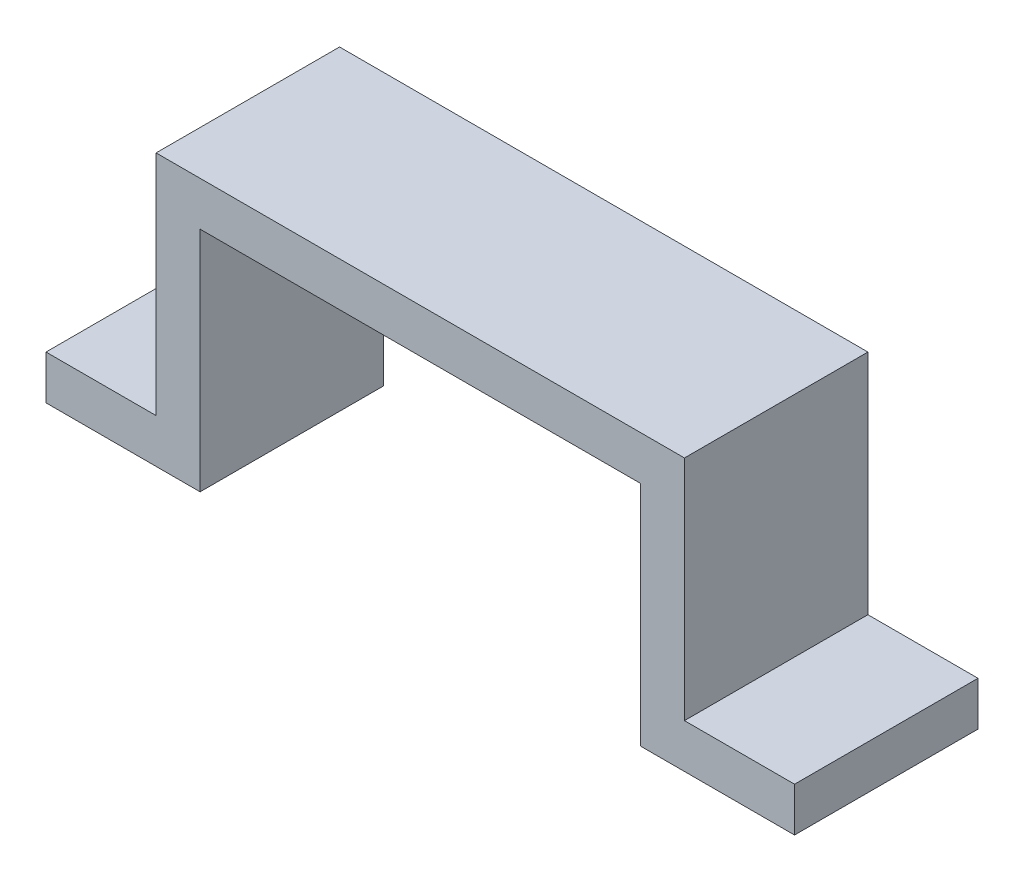
ISO-10303-21;
HEADER;
FILE_DESCRIPTION(('STEP AP214'),'2;1');
FILE_NAME('part.step','',(''),(''),'','','');
FILE_SCHEMA(('AUTOMOTIVE_DESIGN { 1 0 10303 214 1 1 1 1 }'));
ENDSEC;
DATA;
#1=APPLICATION_CONTEXT('core data for automotive mechanical design processes');
#2=APPLICATION_PROTOCOL_DEFINITION('international standard','automotive_design',2000,#1);
#3=PRODUCT_CONTEXT('',#1,'mechanical');
#4=PRODUCT('Part','Part','',(#3));
#5=PRODUCT_RELATED_PRODUCT_CATEGORY('part','',(#4));
#6=PRODUCT_DEFINITION_FORMATION('','',#4);
#7=PRODUCT_DEFINITION_CONTEXT('part definition',#1,'design');
#8=PRODUCT_DEFINITION('design','',#6,#7);
#9=PRODUCT_DEFINITION_SHAPE('','',#8);
#10=(LENGTH_UNIT() NAMED_UNIT(*) SI_UNIT(.MILLI.,.METRE.));
#11=(NAMED_UNIT(*) PLANE_ANGLE_UNIT() SI_UNIT($,.RADIAN.));
#12=(NAMED_UNIT(*) SI_UNIT($,.STERADIAN.) SOLID_ANGLE_UNIT());
#13=UNCERTAINTY_MEASURE_WITH_UNIT(LENGTH_MEASURE(1.E-05),#10,'distance_accuracy_value','');
#14=(GEOMETRIC_REPRESENTATION_CONTEXT(3) GLOBAL_UNCERTAINTY_ASSIGNED_CONTEXT((#13)) GLOBAL_UNIT_ASSIGNED_CONTEXT((#10,
#11,#12)) REPRESENTATION_CONTEXT('',''));
#15=CARTESIAN_POINT('',(0.,0.,0.));
#16=DIRECTION('',(0.,0.,1.));
#17=DIRECTION('',(1.,0.,0.));
#18=AXIS2_PLACEMENT_3D('',#15,#16,#17);
#19=CARTESIAN_POINT('',(0.,-6.,25.));
#20=DIRECTION('',(1.,0.,0.));
#21=DIRECTION('',(0.,0.,-1.));
#22=AXIS2_PLACEMENT_3D('',#19,#20,#21);
#23=PLANE('',#22);
#24=DIRECTION('',(0.,-1.,0.));
#25=VECTOR('',#24,1.);
#26=CARTESIAN_POINT('',(0.,-6.,0.));
#27=LINE('',#26,#25);
#28=CARTESIAN_POINT('',(0.,0.,0.));
#29=VERTEX_POINT('',#28);
#30=CARTESIAN_POINT('',(0.,-6.,0.));
#31=VERTEX_POINT('',#30);
#32=EDGE_CURVE('E156',#29,#31,#27,.T.);
#33=ORIENTED_EDGE('',*,*,#32,.T.);
#34=DIRECTION('',(0.,0.,-1.));
#35=VECTOR('',#34,1.);
#36=CARTESIAN_POINT('',(0.,-6.,25.));
#37=LINE('',#36,#35);
#38=CARTESIAN_POINT('',(0.,-6.,25.));
#39=VERTEX_POINT('',#38);
#40=EDGE_CURVE('E11',#39,#31,#37,.T.);
#41=ORIENTED_EDGE('',*,*,#40,.F.);
#42=DIRECTION('',(0.,-1.,0.));
#43=VECTOR('',#42,1.);
#44=CARTESIAN_POINT('',(0.,-6.,25.));
#45=LINE('',#44,#43);
#46=CARTESIAN_POINT('',(0.,0.,25.));
#47=VERTEX_POINT('',#46);
#48=EDGE_CURVE('E178',#47,#39,#45,.T.);
#49=ORIENTED_EDGE('',*,*,#48,.F.);
#50=DIRECTION('',(0.,0.,-1.));
#51=VECTOR('',#50,1.);
#52=CARTESIAN_POINT('',(0.,0.,25.));
#53=LINE('',#52,#51);
#54=EDGE_CURVE('E152',#47,#29,#53,.T.);
#55=ORIENTED_EDGE('',*,*,#54,.T.);
#56=EDGE_LOOP('',(#33,#41,#49,#55));
#57=FACE_BOUND('',#56,.T.);
#58=ADVANCED_FACE('F36',(#57),#23,.F.);
#59=CARTESIAN_POINT('',(21.,-6.,25.));
#60=DIRECTION('',(0.,1.,0.));
#61=DIRECTION('',(-1.,0.,0.));
#62=AXIS2_PLACEMENT_3D('',#59,#60,#61);
#63=PLANE('',#62);
#64=DIRECTION('',(1.,0.,0.));
#65=VECTOR('',#64,1.);
#66=CARTESIAN_POINT('',(21.,-6.,0.));
#67=LINE('',#66,#65);
#68=CARTESIAN_POINT('',(21.,-6.,0.));
#69=VERTEX_POINT('',#68);
#70=EDGE_CURVE('E159',#31,#69,#67,.T.);
#71=ORIENTED_EDGE('',*,*,#70,.T.);
#72=DIRECTION('',(0.,0.,-1.));
#73=VECTOR('',#72,1.);
#74=CARTESIAN_POINT('',(21.,-6.,25.));
#75=LINE('',#74,#73);
#76=CARTESIAN_POINT('',(21.,-6.,25.));
#77=VERTEX_POINT('',#76);
#78=EDGE_CURVE('E44',#77,#69,#75,.T.);
#79=ORIENTED_EDGE('',*,*,#78,.F.);
#80=DIRECTION('',(1.,0.,0.));
#81=VECTOR('',#80,1.);
#82=CARTESIAN_POINT('',(21.,-6.,25.));
#83=LINE('',#82,#81);
#84=EDGE_CURVE('E107',#39,#77,#83,.T.);
#85=ORIENTED_EDGE('',*,*,#84,.F.);
#86=ORIENTED_EDGE('',*,*,#40,.T.);
#87=EDGE_LOOP('',(#71,#79,#85,#86));
#88=FACE_BOUND('',#87,.T.);
#89=ADVANCED_FACE('F256',(#88),#63,.F.);
#90=CARTESIAN_POINT('',(21.,25.,25.));
#91=DIRECTION('',(-1.,0.,0.));
#92=DIRECTION('',(0.,-1.,0.));
#93=AXIS2_PLACEMENT_3D('',#90,#91,#92);
#94=PLANE('',#93);
#95=DIRECTION('',(0.,1.,0.));
#96=VECTOR('',#95,1.);
#97=CARTESIAN_POINT('',(21.,25.,0.));
#98=LINE('',#97,#96);
#99=CARTESIAN_POINT('',(21.,25.,0.));
#100=VERTEX_POINT('',#99);
#101=EDGE_CURVE('E161',#69,#100,#98,.T.);
#102=ORIENTED_EDGE('',*,*,#101,.T.);
#103=DIRECTION('',(0.,0.,-1.));
#104=VECTOR('',#103,1.);
#105=CARTESIAN_POINT('',(21.,25.,25.));
#106=LINE('',#105,#104);
#107=CARTESIAN_POINT('',(21.,25.,25.));
#108=VERTEX_POINT('',#107);
#109=EDGE_CURVE('E197',#108,#100,#106,.T.);
#110=ORIENTED_EDGE('',*,*,#109,.F.);
#111=DIRECTION('',(0.,1.,0.));
#112=VECTOR('',#111,1.);
#113=CARTESIAN_POINT('',(21.,25.,25.));
#114=LINE('',#113,#112);
#115=EDGE_CURVE('E205',#77,#108,#114,.T.);
#116=ORIENTED_EDGE('',*,*,#115,.F.);
#117=ORIENTED_EDGE('',*,*,#78,.T.);
#118=EDGE_LOOP('',(#102,#110,#116,#117));
#119=FACE_BOUND('',#118,.T.);
#120=ADVANCED_FACE('F203',(#119),#94,.F.);
#121=CARTESIAN_POINT('',(81.,25.,25.));
#122=DIRECTION('',(0.,1.,0.));
#123=DIRECTION('',(-1.,0.,0.));
#124=AXIS2_PLACEMENT_3D('',#121,#122,#123);
#125=PLANE('',#124);
#126=DIRECTION('',(1.,0.,0.));
#127=VECTOR('',#126,1.);
#128=CARTESIAN_POINT('',(81.,25.,0.));
#129=LINE('',#128,#127);
#130=CARTESIAN_POINT('',(81.,25.,0.));
#131=VERTEX_POINT('',#130);
#132=EDGE_CURVE('E163',#100,#131,#129,.T.);
#133=ORIENTED_EDGE('',*,*,#132,.T.);
#134=DIRECTION('',(0.,0.,-1.));
#135=VECTOR('',#134,1.);
#136=CARTESIAN_POINT('',(81.,25.,25.));
#137=LINE('',#136,#135);
#138=CARTESIAN_POINT('',(81.,25.,25.));
#139=VERTEX_POINT('',#138);
#140=EDGE_CURVE('E194',#139,#131,#137,.T.);
#141=ORIENTED_EDGE('',*,*,#140,.F.);
#142=DIRECTION('',(1.,0.,0.));
#143=VECTOR('',#142,1.);
#144=CARTESIAN_POINT('',(81.,25.,25.));
#145=LINE('',#144,#143);
#146=EDGE_CURVE('E223',#108,#139,#145,.T.);
#147=ORIENTED_EDGE('',*,*,#146,.F.);
#148=ORIENTED_EDGE('',*,*,#109,.T.);
#149=EDGE_LOOP('',(#133,#141,#147,#148));
#150=FACE_BOUND('',#149,.T.);
#151=ADVANCED_FACE('F214',(#150),#125,.F.);
#152=CARTESIAN_POINT('',(81.,-6.,25.));
#153=DIRECTION('',(1.,0.,0.));
#154=DIRECTION('',(0.,1.,0.));
#155=AXIS2_PLACEMENT_3D('',#152,#153,#154);
#156=PLANE('',#155);
#157=DIRECTION('',(0.,-1.,0.));
#158=VECTOR('',#157,1.);
#159=CARTESIAN_POINT('',(81.,-6.,0.));
#160=LINE('',#159,#158);
#161=CARTESIAN_POINT('',(81.,-6.,0.));
#162=VERTEX_POINT('',#161);
#163=EDGE_CURVE('E165',#131,#162,#160,.T.);
#164=ORIENTED_EDGE('',*,*,#163,.T.);
#165=DIRECTION('',(0.,0.,-1.));
#166=VECTOR('',#165,1.);
#167=CARTESIAN_POINT('',(81.,-6.,25.));
#168=LINE('',#167,#166);
#169=CARTESIAN_POINT('',(81.,-6.,25.));
#170=VERTEX_POINT('',#169);
#171=EDGE_CURVE('E191',#170,#162,#168,.T.);
#172=ORIENTED_EDGE('',*,*,#171,.F.);
#173=DIRECTION('',(0.,-1.,0.));
#174=VECTOR('',#173,1.);
#175=CARTESIAN_POINT('',(81.,-6.,25.));
#176=LINE('',#175,#174);
#177=EDGE_CURVE('E220',#139,#170,#176,.T.);
#178=ORIENTED_EDGE('',*,*,#177,.F.);
#179=ORIENTED_EDGE('',*,*,#140,.T.);
#180=EDGE_LOOP('',(#164,#172,#178,#179));
#181=FACE_BOUND('',#180,.T.);
#182=ADVANCED_FACE('F218',(#181),#156,.F.);
#183=CARTESIAN_POINT('',(102.,-6.,25.));
#184=DIRECTION('',(0.,1.,0.));
#185=DIRECTION('',(-1.,0.,0.));
#186=AXIS2_PLACEMENT_3D('',#183,#184,#185);
#187=PLANE('',#186);
#188=DIRECTION('',(1.,0.,0.));
#189=VECTOR('',#188,1.);
#190=CARTESIAN_POINT('',(102.,-6.,0.));
#191=LINE('',#190,#189);
#192=CARTESIAN_POINT('',(102.,-6.,0.));
#193=VERTEX_POINT('',#192);
#194=EDGE_CURVE('E167',#162,#193,#191,.T.);
#195=ORIENTED_EDGE('',*,*,#194,.T.);
#196=DIRECTION('',(0.,0.,-1.));
#197=VECTOR('',#196,1.);
#198=CARTESIAN_POINT('',(102.,-6.,25.));
#199=LINE('',#198,#197);
#200=CARTESIAN_POINT('',(102.,-6.,25.));
#201=VERTEX_POINT('',#200);
#202=EDGE_CURVE('E188',#201,#193,#199,.T.);
#203=ORIENTED_EDGE('',*,*,#202,.F.);
#204=DIRECTION('',(1.,0.,0.));
#205=VECTOR('',#204,1.);
#206=CARTESIAN_POINT('',(102.,-6.,25.));
#207=LINE('',#206,#205);
#208=EDGE_CURVE('E222',#170,#201,#207,.T.);
#209=ORIENTED_EDGE('',*,*,#208,.F.);
#210=ORIENTED_EDGE('',*,*,#171,.T.);
#211=EDGE_LOOP('',(#195,#203,#209,#210));
#212=FACE_BOUND('',#211,.T.);
#213=ADVANCED_FACE('F269',(#212),#187,.F.);
#214=CARTESIAN_POINT('',(102.,0.,25.));
#215=DIRECTION('',(-1.,0.,0.));
#216=DIRECTION('',(0.,0.,1.));
#217=AXIS2_PLACEMENT_3D('',#214,#215,#216);
#218=PLANE('',#217);
#219=DIRECTION('',(0.,1.,0.));
#220=VECTOR('',#219,1.);
#221=CARTESIAN_POINT('',(102.,0.,0.));
#222=LINE('',#221,#220);
#223=CARTESIAN_POINT('',(102.,0.,0.));
#224=VERTEX_POINT('',#223);
#225=EDGE_CURVE('E169',#193,#224,#222,.T.);
#226=ORIENTED_EDGE('',*,*,#225,.T.);
#227=DIRECTION('',(0.,0.,-1.));
#228=VECTOR('',#227,1.);
#229=CARTESIAN_POINT('',(102.,0.,25.));
#230=LINE('',#229,#228);
#231=CARTESIAN_POINT('',(102.,0.,25.));
#232=VERTEX_POINT('',#231);
#233=EDGE_CURVE('E185',#232,#224,#230,.T.);
#234=ORIENTED_EDGE('',*,*,#233,.F.);
#235=DIRECTION('',(0.,1.,0.));
#236=VECTOR('',#235,1.);
#237=CARTESIAN_POINT('',(102.,0.,25.));
#238=LINE('',#237,#236);
#239=EDGE_CURVE('E225',#201,#232,#238,.T.);
#240=ORIENTED_EDGE('',*,*,#239,.F.);
#241=ORIENTED_EDGE('',*,*,#202,.T.);
#242=EDGE_LOOP('',(#226,#234,#240,#241));
#243=FACE_BOUND('',#242,.T.);
#244=ADVANCED_FACE('F272',(#243),#218,.F.);
#245=CARTESIAN_POINT('',(87.,0.,25.));
#246=DIRECTION('',(0.,-1.,0.));
#247=DIRECTION('',(1.,0.,0.));
#248=AXIS2_PLACEMENT_3D('',#245,#246,#247);
#249=PLANE('',#248);
#250=DIRECTION('',(-1.,0.,0.));
#251=VECTOR('',#250,1.);
#252=CARTESIAN_POINT('',(87.,0.,0.));
#253=LINE('',#252,#251);
#254=CARTESIAN_POINT('',(87.,0.,0.));
#255=VERTEX_POINT('',#254);
#256=EDGE_CURVE('E171',#224,#255,#253,.T.);
#257=ORIENTED_EDGE('',*,*,#256,.T.);
#258=DIRECTION('',(0.,0.,-1.));
#259=VECTOR('',#258,1.);
#260=CARTESIAN_POINT('',(87.,0.,25.));
#261=LINE('',#260,#259);
#262=CARTESIAN_POINT('',(87.,0.,25.));
#263=VERTEX_POINT('',#262);
#264=EDGE_CURVE('E182',#263,#255,#261,.T.);
#265=ORIENTED_EDGE('',*,*,#264,.F.);
#266=DIRECTION('',(-1.,0.,0.));
#267=VECTOR('',#266,1.);
#268=CARTESIAN_POINT('',(87.,0.,25.));
#269=LINE('',#268,#267);
#270=EDGE_CURVE('E231',#232,#263,#269,.T.);
#271=ORIENTED_EDGE('',*,*,#270,.F.);
#272=ORIENTED_EDGE('',*,*,#233,.T.);
#273=EDGE_LOOP('',(#257,#265,#271,#272));
#274=FACE_BOUND('',#273,.T.);
#275=ADVANCED_FACE('F237',(#274),#249,.F.);
#276=CARTESIAN_POINT('',(87.,31.,25.));
#277=DIRECTION('',(-1.,0.,0.));
#278=DIRECTION('',(0.,0.,1.));
#279=AXIS2_PLACEMENT_3D('',#276,#277,#278);
#280=PLANE('',#279);
#281=DIRECTION('',(0.,1.,0.));
#282=VECTOR('',#281,1.);
#283=CARTESIAN_POINT('',(87.,31.,0.));
#284=LINE('',#283,#282);
#285=CARTESIAN_POINT('',(87.,31.,0.));
#286=VERTEX_POINT('',#285);
#287=EDGE_CURVE('E173',#255,#286,#284,.T.);
#288=ORIENTED_EDGE('',*,*,#287,.T.);
#289=DIRECTION('',(0.,0.,-1.));
#290=VECTOR('',#289,1.);
#291=CARTESIAN_POINT('',(87.,31.,25.));
#292=LINE('',#291,#290);
#293=CARTESIAN_POINT('',(87.,31.,25.));
#294=VERTEX_POINT('',#293);
#295=EDGE_CURVE('E147',#294,#286,#292,.T.);
#296=ORIENTED_EDGE('',*,*,#295,.F.);
#297=DIRECTION('',(0.,1.,0.));
#298=VECTOR('',#297,1.);
#299=CARTESIAN_POINT('',(87.,31.,25.));
#300=LINE('',#299,#298);
#301=EDGE_CURVE('E138',#263,#294,#300,.T.);
#302=ORIENTED_EDGE('',*,*,#301,.F.);
#303=ORIENTED_EDGE('',*,*,#264,.T.);
#304=EDGE_LOOP('',(#288,#296,#302,#303));
#305=FACE_BOUND('',#304,.T.);
#306=ADVANCED_FACE('F241',(#305),#280,.F.);
#307=CARTESIAN_POINT('',(15.,31.,25.));
#308=DIRECTION('',(0.,-1.,0.));
#309=DIRECTION('',(0.,0.,-1.));
#310=AXIS2_PLACEMENT_3D('',#307,#308,#309);
#311=PLANE('',#310);
#312=DIRECTION('',(-1.,0.,0.));
#313=VECTOR('',#312,1.);
#314=CARTESIAN_POINT('',(15.,31.,0.));
#315=LINE('',#314,#313);
#316=CARTESIAN_POINT('',(15.,31.,0.));
#317=VERTEX_POINT('',#316);
#318=EDGE_CURVE('E146',#286,#317,#315,.T.);
#319=ORIENTED_EDGE('',*,*,#318,.T.);
#320=DIRECTION('',(0.,0.,-1.));
#321=VECTOR('',#320,1.);
#322=CARTESIAN_POINT('',(15.,31.,25.));
#323=LINE('',#322,#321);
#324=CARTESIAN_POINT('',(15.,31.,25.));
#325=VERTEX_POINT('',#324);
#326=EDGE_CURVE('E143',#325,#317,#323,.T.);
#327=ORIENTED_EDGE('',*,*,#326,.F.);
#328=DIRECTION('',(-1.,0.,0.));
#329=VECTOR('',#328,1.);
#330=CARTESIAN_POINT('',(15.,31.,25.));
#331=LINE('',#330,#329);
#332=EDGE_CURVE('E132',#294,#325,#331,.T.);
#333=ORIENTED_EDGE('',*,*,#332,.F.);
#334=ORIENTED_EDGE('',*,*,#295,.T.);
#335=EDGE_LOOP('',(#319,#327,#333,#334));
#336=FACE_BOUND('',#335,.T.);
#337=ADVANCED_FACE('F144',(#336),#311,.F.);
#338=CARTESIAN_POINT('',(15.,0.,25.));
#339=DIRECTION('',(1.,0.,0.));
#340=DIRECTION('',(0.,0.,-1.));
#341=AXIS2_PLACEMENT_3D('',#338,#339,#340);
#342=PLANE('',#341);
#343=DIRECTION('',(0.,-1.,0.));
#344=VECTOR('',#343,1.);
#345=CARTESIAN_POINT('',(15.,0.,0.));
#346=LINE('',#345,#344);
#347=CARTESIAN_POINT('',(15.,0.,0.));
#348=VERTEX_POINT('',#347);
#349=EDGE_CURVE('E93',#317,#348,#346,.T.);
#350=ORIENTED_EDGE('',*,*,#349,.T.);
#351=DIRECTION('',(0.,0.,-1.));
#352=VECTOR('',#351,1.);
#353=CARTESIAN_POINT('',(15.,0.,25.));
#354=LINE('',#353,#352);
#355=CARTESIAN_POINT('',(15.,0.,25.));
#356=VERTEX_POINT('',#355);
#357=EDGE_CURVE('E148',#356,#348,#354,.T.);
#358=ORIENTED_EDGE('',*,*,#357,.F.);
#359=DIRECTION('',(0.,-1.,0.));
#360=VECTOR('',#359,1.);
#361=CARTESIAN_POINT('',(15.,0.,25.));
#362=LINE('',#361,#360);
#363=EDGE_CURVE('E136',#325,#356,#362,.T.);
#364=ORIENTED_EDGE('',*,*,#363,.F.);
#365=ORIENTED_EDGE('',*,*,#326,.T.);
#366=EDGE_LOOP('',(#350,#358,#364,#365));
#367=FACE_BOUND('',#366,.T.);
#368=ADVANCED_FACE('F150',(#367),#342,.F.);
#369=CARTESIAN_POINT('',(0.,0.,25.));
#370=DIRECTION('',(0.,-1.,0.));
#371=DIRECTION('',(0.,0.,-1.));
#372=AXIS2_PLACEMENT_3D('',#369,#370,#371);
#373=PLANE('',#372);
#374=DIRECTION('',(-1.,0.,0.));
#375=VECTOR('',#374,1.);
#376=CARTESIAN_POINT('',(0.,0.,0.));
#377=LINE('',#376,#375);
#378=EDGE_CURVE('E99',#348,#29,#377,.T.);
#379=ORIENTED_EDGE('',*,*,#378,.T.);
#380=ORIENTED_EDGE('',*,*,#54,.F.);
#381=DIRECTION('',(-1.,0.,0.));
#382=VECTOR('',#381,1.);
#383=CARTESIAN_POINT('',(0.,0.,25.));
#384=LINE('',#383,#382);
#385=EDGE_CURVE('E52',#356,#47,#384,.T.);
#386=ORIENTED_EDGE('',*,*,#385,.F.);
#387=ORIENTED_EDGE('',*,*,#357,.T.);
#388=EDGE_LOOP('',(#379,#380,#386,#387));
#389=FACE_BOUND('',#388,.T.);
#390=ADVANCED_FACE('F245',(#389),#373,.F.);
#391=CARTESIAN_POINT('',(0.,0.,25.));
#392=DIRECTION('',(0.,0.,-1.));
#393=DIRECTION('',(-1.,0.,0.));
#394=AXIS2_PLACEMENT_3D('',#391,#392,#393);
#395=PLANE('',#394);
#396=ORIENTED_EDGE('',*,*,#48,.T.);
#397=ORIENTED_EDGE('',*,*,#84,.T.);
#398=ORIENTED_EDGE('',*,*,#115,.T.);
#399=ORIENTED_EDGE('',*,*,#146,.T.);
#400=ORIENTED_EDGE('',*,*,#177,.T.);
#401=ORIENTED_EDGE('',*,*,#208,.T.);
#402=ORIENTED_EDGE('',*,*,#239,.T.);
#403=ORIENTED_EDGE('',*,*,#270,.T.);
#404=ORIENTED_EDGE('',*,*,#301,.T.);
#405=ORIENTED_EDGE('',*,*,#332,.T.);
#406=ORIENTED_EDGE('',*,*,#363,.T.);
#407=ORIENTED_EDGE('',*,*,#385,.T.);
#408=EDGE_LOOP('',(#396,#397,#398,#399,#400,#401,#402,#403,#404,#405,#406,#407));
#409=FACE_BOUND('',#408,.T.);
#410=ADVANCED_FACE('F134',(#409),#395,.F.);
#411=CARTESIAN_POINT('',(0.,0.,0.));
#412=DIRECTION('',(0.,0.,-1.));
#413=DIRECTION('',(-1.,0.,0.));
#414=AXIS2_PLACEMENT_3D('',#411,#412,#413);
#415=PLANE('',#414);
#416=ORIENTED_EDGE('',*,*,#32,.F.);
#417=ORIENTED_EDGE('',*,*,#378,.F.);
#418=ORIENTED_EDGE('',*,*,#349,.F.);
#419=ORIENTED_EDGE('',*,*,#318,.F.);
#420=ORIENTED_EDGE('',*,*,#287,.F.);
#421=ORIENTED_EDGE('',*,*,#256,.F.);
#422=ORIENTED_EDGE('',*,*,#225,.F.);
#423=ORIENTED_EDGE('',*,*,#194,.F.);
#424=ORIENTED_EDGE('',*,*,#163,.F.);
#425=ORIENTED_EDGE('',*,*,#132,.F.);
#426=ORIENTED_EDGE('',*,*,#101,.F.);
#427=ORIENTED_EDGE('',*,*,#70,.F.);
#428=EDGE_LOOP('',(#416,#417,#418,#419,#420,#421,#422,#423,#424,#425,#426,#427));
#429=FACE_BOUND('',#428,.T.);
#430=ADVANCED_FACE('F209',(#429),#415,.T.);
#431=CLOSED_SHELL('',(#58,#89,#120,#151,#182,#213,#244,#275,#306,#337,#368,#390,#410,#430));
#432=MANIFOLD_SOLID_BREP('B2',#431);
#433=ADVANCED_BREP_SHAPE_REPRESENTATION('',(#18,#432),#14);
#434=SHAPE_DEFINITION_REPRESENTATION(#9,#433);
ENDSEC;
END-ISO-10303-21;
